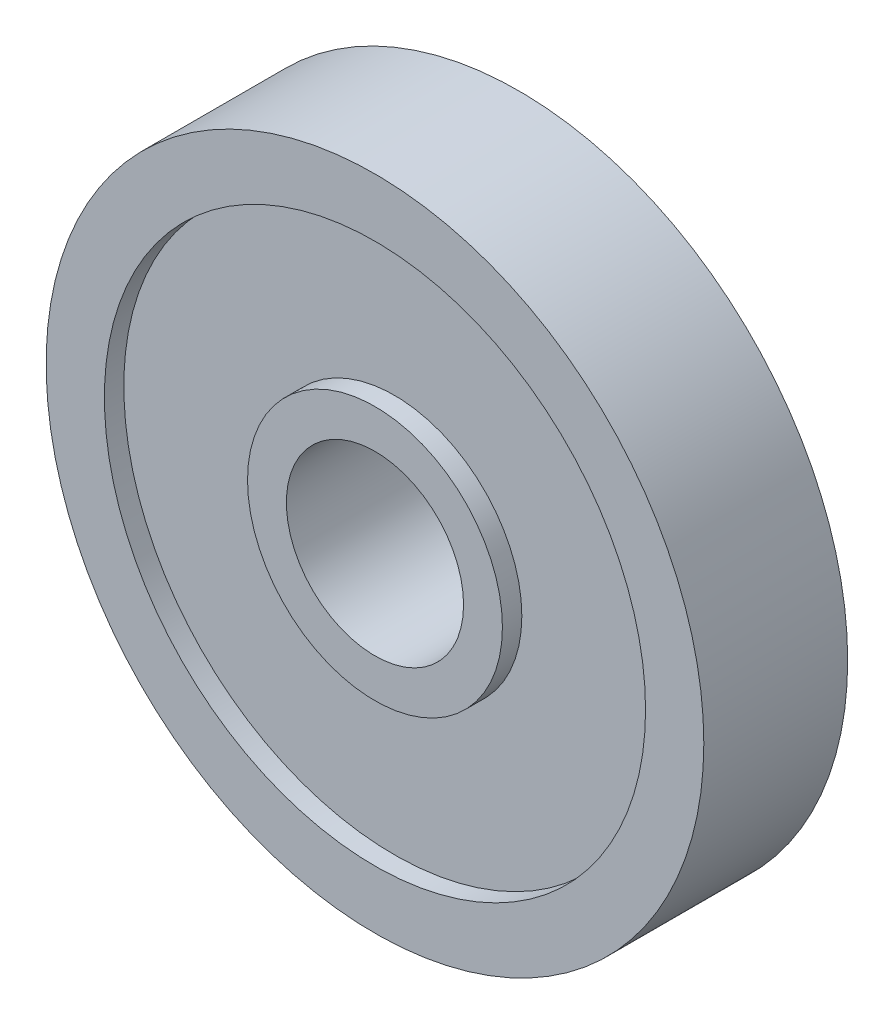
ISO-10303-21;
HEADER;
FILE_DESCRIPTION(('STEP AP214'),'2;1');
FILE_NAME('part.step','',(''),(''),'','','');
FILE_SCHEMA(('AUTOMOTIVE_DESIGN { 1 0 10303 214 1 1 1 1 }'));
ENDSEC;
DATA;
#1=APPLICATION_CONTEXT('core data for automotive mechanical design processes');
#2=APPLICATION_PROTOCOL_DEFINITION('international standard','automotive_design',2000,#1);
#3=PRODUCT_CONTEXT('',#1,'mechanical');
#4=PRODUCT('Part','Part','',(#3));
#5=PRODUCT_RELATED_PRODUCT_CATEGORY('part','',(#4));
#6=PRODUCT_DEFINITION_FORMATION('','',#4);
#7=PRODUCT_DEFINITION_CONTEXT('part definition',#1,'design');
#8=PRODUCT_DEFINITION('design','',#6,#7);
#9=PRODUCT_DEFINITION_SHAPE('','',#8);
#10=(LENGTH_UNIT() NAMED_UNIT(*) SI_UNIT(.MILLI.,.METRE.));
#11=(NAMED_UNIT(*) PLANE_ANGLE_UNIT() SI_UNIT($,.RADIAN.));
#12=(NAMED_UNIT(*) SI_UNIT($,.STERADIAN.) SOLID_ANGLE_UNIT());
#13=UNCERTAINTY_MEASURE_WITH_UNIT(LENGTH_MEASURE(1.E-05),#10,'distance_accuracy_value','');
#14=(GEOMETRIC_REPRESENTATION_CONTEXT(3) GLOBAL_UNCERTAINTY_ASSIGNED_CONTEXT((#13)) GLOBAL_UNIT_ASSIGNED_CONTEXT((#10,
#11,#12)) REPRESENTATION_CONTEXT('',''));
#15=CARTESIAN_POINT('',(0.,0.,0.));
#16=DIRECTION('',(0.,0.,1.));
#17=DIRECTION('',(1.,0.,0.));
#18=AXIS2_PLACEMENT_3D('',#15,#16,#17);
#19=CARTESIAN_POINT('',(-108.042890629012,14.6364798694711,0.));
#20=DIRECTION('',(0.,0.,1.));
#21=DIRECTION('',(1.,0.,0.));
#22=AXIS2_PLACEMENT_3D('',#19,#20,#21);
#23=PLANE('',#22);
#24=CARTESIAN_POINT('',(-108.042890629012,14.6364798694711,0.));
#25=DIRECTION('',(0.,0.,1.));
#26=DIRECTION('',(1.,0.,0.));
#27=AXIS2_PLACEMENT_3D('',#24,#25,#26);
#28=CIRCLE('',#27,4.5625);
#29=CARTESIAN_POINT('',(-103.480390629012,14.6364798694711,0.));
#30=VERTEX_POINT('',#29);
#31=EDGE_CURVE('E56',#30,#30,#28,.T.);
#32=ORIENTED_EDGE('',*,*,#31,.T.);
#33=EDGE_LOOP('',(#32));
#34=FACE_BOUND('',#33,.T.);
#35=CARTESIAN_POINT('',(-108.042890629012,14.6364798694711,0.));
#36=DIRECTION('',(0.,0.,1.));
#37=DIRECTION('',(1.,0.,0.));
#38=AXIS2_PLACEMENT_3D('',#35,#36,#37);
#39=CIRCLE('',#38,6.5625);
#40=CARTESIAN_POINT('',(-101.480390629012,14.6364798694711,0.));
#41=VERTEX_POINT('',#40);
#42=EDGE_CURVE('E80',#41,#41,#39,.T.);
#43=ORIENTED_EDGE('',*,*,#42,.F.);
#44=EDGE_LOOP('',(#43));
#45=FACE_BOUND('',#44,.T.);
#46=ADVANCED_FACE('F43',(#34,#45),#23,.F.);
#47=CARTESIAN_POINT('',(-108.042890629012,14.6364798694711,7.40833333333333));
#48=DIRECTION('',(0.,0.,1.));
#49=DIRECTION('',(1.,0.,0.));
#50=AXIS2_PLACEMENT_3D('',#47,#48,#49);
#51=PLANE('',#50);
#52=CARTESIAN_POINT('',(-108.042890629012,14.6364798694711,7.40833333333333));
#53=DIRECTION('',(0.,0.,1.));
#54=DIRECTION('',(1.,0.,0.));
#55=AXIS2_PLACEMENT_3D('',#52,#53,#54);
#56=CIRCLE('',#55,4.5625);
#57=CARTESIAN_POINT('',(-103.480390629012,14.6364798694711,7.40833333333333));
#58=VERTEX_POINT('',#57);
#59=EDGE_CURVE('E54',#58,#58,#56,.T.);
#60=ORIENTED_EDGE('',*,*,#59,.F.);
#61=EDGE_LOOP('',(#60));
#62=FACE_BOUND('',#61,.T.);
#63=CARTESIAN_POINT('',(-108.042890629012,14.6364798694711,7.40833333333333));
#64=DIRECTION('',(0.,0.,1.));
#65=DIRECTION('',(1.,0.,0.));
#66=AXIS2_PLACEMENT_3D('',#63,#64,#65);
#67=CIRCLE('',#66,6.5625);
#68=CARTESIAN_POINT('',(-101.480390629012,14.6364798694711,7.40833333333333));
#69=VERTEX_POINT('',#68);
#70=EDGE_CURVE('E68',#69,#69,#67,.T.);
#71=ORIENTED_EDGE('',*,*,#70,.T.);
#72=EDGE_LOOP('',(#71));
#73=FACE_BOUND('',#72,.T.);
#74=ADVANCED_FACE('F96',(#62,#73),#51,.T.);
#75=CARTESIAN_POINT('',(-108.042890629012,14.6364798694711,7.40833333333333));
#76=DIRECTION('',(0.,0.,1.));
#77=DIRECTION('',(1.,0.,0.));
#78=AXIS2_PLACEMENT_3D('',#75,#76,#77);
#79=CIRCLE('',#78,13.9333333333333);
#80=CARTESIAN_POINT('',(-94.1095572956788,14.6364798694711,7.40833333333333));
#81=VERTEX_POINT('',#80);
#82=EDGE_CURVE('E62',#81,#81,#79,.T.);
#83=ORIENTED_EDGE('',*,*,#82,.F.);
#84=EDGE_LOOP('',(#83));
#85=FACE_BOUND('',#84,.T.);
#86=CARTESIAN_POINT('',(-108.042890629012,14.6364798694711,7.40833333333333));
#87=DIRECTION('',(0.,0.,1.));
#88=DIRECTION('',(1.,0.,0.));
#89=AXIS2_PLACEMENT_3D('',#86,#87,#88);
#90=CIRCLE('',#89,16.9333333333333);
#91=CARTESIAN_POINT('',(-91.1095572956788,14.6364798694711,7.40833333333333));
#92=VERTEX_POINT('',#91);
#93=EDGE_CURVE('E12',#92,#92,#90,.T.);
#94=ORIENTED_EDGE('',*,*,#93,.T.);
#95=EDGE_LOOP('',(#94));
#96=FACE_BOUND('',#95,.T.);
#97=ADVANCED_FACE('F102',(#85,#96),#51,.T.);
#98=CARTESIAN_POINT('',(-108.042890629012,14.6364798694711,0.));
#99=DIRECTION('',(0.,0.,1.));
#100=DIRECTION('',(1.,0.,0.));
#101=AXIS2_PLACEMENT_3D('',#98,#99,#100);
#102=CIRCLE('',#101,13.9333333333333);
#103=CARTESIAN_POINT('',(-94.1095572956788,14.6364798694711,0.));
#104=VERTEX_POINT('',#103);
#105=EDGE_CURVE('E74',#104,#104,#102,.T.);
#106=ORIENTED_EDGE('',*,*,#105,.T.);
#107=EDGE_LOOP('',(#106));
#108=FACE_BOUND('',#107,.T.);
#109=CARTESIAN_POINT('',(-108.042890629012,14.6364798694711,0.));
#110=DIRECTION('',(0.,0.,1.));
#111=DIRECTION('',(1.,0.,0.));
#112=AXIS2_PLACEMENT_3D('',#109,#110,#111);
#113=CIRCLE('',#112,16.9333333333333);
#114=CARTESIAN_POINT('',(-91.1095572956788,14.6364798694711,0.));
#115=VERTEX_POINT('',#114);
#116=EDGE_CURVE('E47',#115,#115,#113,.T.);
#117=ORIENTED_EDGE('',*,*,#116,.F.);
#118=EDGE_LOOP('',(#117));
#119=FACE_BOUND('',#118,.T.);
#120=ADVANCED_FACE('F98',(#108,#119),#23,.F.);
#121=CARTESIAN_POINT('',(-108.042890629012,14.6364798694711,7.40833333333333));
#122=DIRECTION('',(0.,0.,-1.));
#123=DIRECTION('',(-1.,0.,0.));
#124=AXIS2_PLACEMENT_3D('',#121,#122,#123);
#125=CYLINDRICAL_SURFACE('',#124,16.9333333333333);
#126=ORIENTED_EDGE('',*,*,#93,.F.);
#127=EDGE_LOOP('',(#126));
#128=FACE_BOUND('',#127,.T.);
#129=ORIENTED_EDGE('',*,*,#116,.T.);
#130=EDGE_LOOP('',(#129));
#131=FACE_BOUND('',#130,.T.);
#132=ADVANCED_FACE('F45',(#128,#131),#125,.T.);
#133=CARTESIAN_POINT('',(-108.042890629012,14.6364798694711,7.40833333333333));
#134=DIRECTION('',(0.,0.,-1.));
#135=DIRECTION('',(-1.,0.,0.));
#136=AXIS2_PLACEMENT_3D('',#133,#134,#135);
#137=CYLINDRICAL_SURFACE('',#136,4.5625);
#138=ORIENTED_EDGE('',*,*,#59,.T.);
#139=EDGE_LOOP('',(#138));
#140=FACE_BOUND('',#139,.T.);
#141=ORIENTED_EDGE('',*,*,#31,.F.);
#142=EDGE_LOOP('',(#141));
#143=FACE_BOUND('',#142,.T.);
#144=ADVANCED_FACE('F111',(#140,#143),#137,.F.);
#145=CARTESIAN_POINT('',(-108.042890629012,14.6364798694711,6.40833333333333));
#146=DIRECTION('',(0.,0.,1.));
#147=DIRECTION('',(1.,0.,0.));
#148=AXIS2_PLACEMENT_3D('',#145,#146,#147);
#149=CYLINDRICAL_SURFACE('',#148,13.9333333333333);
#150=CARTESIAN_POINT('',(-108.042890629012,14.6364798694711,6.40833333333333));
#151=DIRECTION('',(0.,0.,1.));
#152=DIRECTION('',(1.,0.,0.));
#153=AXIS2_PLACEMENT_3D('',#150,#151,#152);
#154=CIRCLE('',#153,13.9333333333333);
#155=CARTESIAN_POINT('',(-94.1095572956788,14.6364798694711,6.40833333333333));
#156=VERTEX_POINT('',#155);
#157=EDGE_CURVE('E59',#156,#156,#154,.T.);
#158=ORIENTED_EDGE('',*,*,#157,.F.);
#159=EDGE_LOOP('',(#158));
#160=FACE_BOUND('',#159,.T.);
#161=ORIENTED_EDGE('',*,*,#82,.T.);
#162=EDGE_LOOP('',(#161));
#163=FACE_BOUND('',#162,.T.);
#164=ADVANCED_FACE('F135',(#160,#163),#149,.F.);
#165=CARTESIAN_POINT('',(-108.042890629012,14.6364798694711,6.40833333333333));
#166=DIRECTION('',(0.,0.,1.));
#167=DIRECTION('',(1.,0.,0.));
#168=AXIS2_PLACEMENT_3D('',#165,#166,#167);
#169=PLANE('',#168);
#170=CARTESIAN_POINT('',(-108.042890629012,14.6364798694711,6.40833333333333));
#171=DIRECTION('',(0.,0.,1.));
#172=DIRECTION('',(1.,0.,0.));
#173=AXIS2_PLACEMENT_3D('',#170,#171,#172);
#174=CIRCLE('',#173,6.5625);
#175=CARTESIAN_POINT('',(-101.480390629012,14.6364798694711,6.40833333333333));
#176=VERTEX_POINT('',#175);
#177=EDGE_CURVE('E65',#176,#176,#174,.T.);
#178=ORIENTED_EDGE('',*,*,#177,.F.);
#179=EDGE_LOOP('',(#178));
#180=FACE_BOUND('',#179,.T.);
#181=ORIENTED_EDGE('',*,*,#157,.T.);
#182=EDGE_LOOP('',(#181));
#183=FACE_BOUND('',#182,.T.);
#184=ADVANCED_FACE('F131',(#180,#183),#169,.T.);
#185=CARTESIAN_POINT('',(-108.042890629012,14.6364798694711,6.40833333333333));
#186=DIRECTION('',(0.,0.,1.));
#187=DIRECTION('',(1.,0.,0.));
#188=AXIS2_PLACEMENT_3D('',#185,#186,#187);
#189=CYLINDRICAL_SURFACE('',#188,6.5625);
#190=ORIENTED_EDGE('',*,*,#177,.T.);
#191=EDGE_LOOP('',(#190));
#192=FACE_BOUND('',#191,.T.);
#193=ORIENTED_EDGE('',*,*,#70,.F.);
#194=EDGE_LOOP('',(#193));
#195=FACE_BOUND('',#194,.T.);
#196=ADVANCED_FACE('F125',(#192,#195),#189,.T.);
#197=CARTESIAN_POINT('',(-108.042890629012,14.6364798694711,1.));
#198=DIRECTION('',(0.,0.,-1.));
#199=DIRECTION('',(1.,0.,0.));
#200=AXIS2_PLACEMENT_3D('',#197,#198,#199);
#201=PLANE('',#200);
#202=CARTESIAN_POINT('',(-108.042890629012,14.6364798694711,1.));
#203=DIRECTION('',(0.,0.,1.));
#204=DIRECTION('',(1.,0.,0.));
#205=AXIS2_PLACEMENT_3D('',#202,#203,#204);
#206=CIRCLE('',#205,13.9333333333333);
#207=CARTESIAN_POINT('',(-94.1095572956788,14.6364798694711,1.));
#208=VERTEX_POINT('',#207);
#209=EDGE_CURVE('E71',#208,#208,#206,.T.);
#210=ORIENTED_EDGE('',*,*,#209,.F.);
#211=EDGE_LOOP('',(#210));
#212=FACE_BOUND('',#211,.T.);
#213=CARTESIAN_POINT('',(-108.042890629012,14.6364798694711,1.));
#214=DIRECTION('',(0.,0.,1.));
#215=DIRECTION('',(1.,0.,0.));
#216=AXIS2_PLACEMENT_3D('',#213,#214,#215);
#217=CIRCLE('',#216,6.5625);
#218=CARTESIAN_POINT('',(-101.480390629012,14.6364798694711,1.));
#219=VERTEX_POINT('',#218);
#220=EDGE_CURVE('E77',#219,#219,#217,.T.);
#221=ORIENTED_EDGE('',*,*,#220,.T.);
#222=EDGE_LOOP('',(#221));
#223=FACE_BOUND('',#222,.T.);
#224=ADVANCED_FACE('F86',(#212,#223),#201,.T.);
#225=CARTESIAN_POINT('',(-108.042890629012,14.6364798694711,1.));
#226=DIRECTION('',(0.,0.,-1.));
#227=DIRECTION('',(-1.,0.,0.));
#228=AXIS2_PLACEMENT_3D('',#225,#226,#227);
#229=CYLINDRICAL_SURFACE('',#228,13.9333333333333);
#230=ORIENTED_EDGE('',*,*,#209,.T.);
#231=EDGE_LOOP('',(#230));
#232=FACE_BOUND('',#231,.T.);
#233=ORIENTED_EDGE('',*,*,#105,.F.);
#234=EDGE_LOOP('',(#233));
#235=FACE_BOUND('',#234,.T.);
#236=ADVANCED_FACE('F91',(#232,#235),#229,.F.);
#237=CARTESIAN_POINT('',(-108.042890629012,14.6364798694711,1.));
#238=DIRECTION('',(0.,0.,-1.));
#239=DIRECTION('',(-1.,0.,0.));
#240=AXIS2_PLACEMENT_3D('',#237,#238,#239);
#241=CYLINDRICAL_SURFACE('',#240,6.5625);
#242=ORIENTED_EDGE('',*,*,#220,.F.);
#243=EDGE_LOOP('',(#242));
#244=FACE_BOUND('',#243,.T.);
#245=ORIENTED_EDGE('',*,*,#42,.T.);
#246=EDGE_LOOP('',(#245));
#247=FACE_BOUND('',#246,.T.);
#248=ADVANCED_FACE('F88',(#244,#247),#241,.T.);
#249=CLOSED_SHELL('',(#46,#74,#97,#120,#132,#144,#164,#184,#196,#224,#236,#248));
#250=MANIFOLD_SOLID_BREP('B2',#249);
#251=ADVANCED_BREP_SHAPE_REPRESENTATION('',(#18,#250),#14);
#252=SHAPE_DEFINITION_REPRESENTATION(#9,#251);
ENDSEC;
END-ISO-10303-21;
